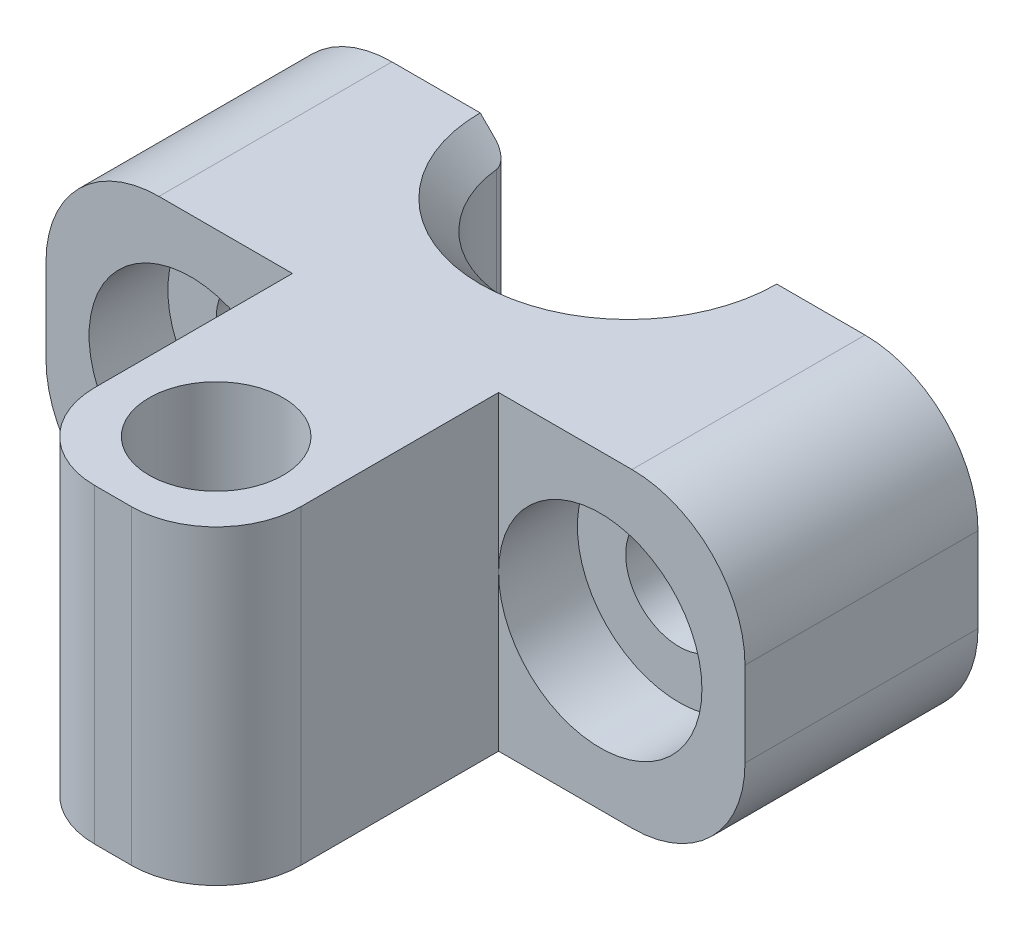
ISO-10303-21;
HEADER;
FILE_DESCRIPTION(('STEP AP214'),'2;1');
FILE_NAME('part.step','',(''),(''),'','','');
FILE_SCHEMA(('AUTOMOTIVE_DESIGN { 1 0 10303 214 1 1 1 1 }'));
ENDSEC;
DATA;
#1=APPLICATION_CONTEXT('core data for automotive mechanical design processes');
#2=APPLICATION_PROTOCOL_DEFINITION('international standard','automotive_design',2000,#1);
#3=PRODUCT_CONTEXT('',#1,'mechanical');
#4=PRODUCT('Part','Part','',(#3));
#5=PRODUCT_RELATED_PRODUCT_CATEGORY('part','',(#4));
#6=PRODUCT_DEFINITION_FORMATION('','',#4);
#7=PRODUCT_DEFINITION_CONTEXT('part definition',#1,'design');
#8=PRODUCT_DEFINITION('design','',#6,#7);
#9=PRODUCT_DEFINITION_SHAPE('','',#8);
#10=(LENGTH_UNIT() NAMED_UNIT(*) SI_UNIT(.MILLI.,.METRE.));
#11=(NAMED_UNIT(*) PLANE_ANGLE_UNIT() SI_UNIT($,.RADIAN.));
#12=(NAMED_UNIT(*) SI_UNIT($,.STERADIAN.) SOLID_ANGLE_UNIT());
#13=UNCERTAINTY_MEASURE_WITH_UNIT(LENGTH_MEASURE(1.E-05),#10,'distance_accuracy_value','');
#14=(GEOMETRIC_REPRESENTATION_CONTEXT(3) GLOBAL_UNCERTAINTY_ASSIGNED_CONTEXT((#13)) GLOBAL_UNIT_ASSIGNED_CONTEXT((#10,
#11,#12)) REPRESENTATION_CONTEXT('',''));
#15=CARTESIAN_POINT('',(0.,0.,0.));
#16=DIRECTION('',(0.,0.,1.));
#17=DIRECTION('',(1.,0.,0.));
#18=AXIS2_PLACEMENT_3D('',#15,#16,#17);
#19=CARTESIAN_POINT('',(0.,0.,8.25));
#20=DIRECTION('',(0.,0.,-1.));
#21=DIRECTION('',(-1.,0.,0.));
#22=AXIS2_PLACEMENT_3D('',#19,#20,#21);
#23=PLANE('',#22);
#24=DIRECTION('',(0.,-1.,0.));
#25=VECTOR('',#24,1.);
#26=CARTESIAN_POINT('',(-3.65000000000001,5.50000000000001,8.25));
#27=LINE('',#26,#25);
#28=CARTESIAN_POINT('',(-3.65000000000001,5.5,8.25));
#29=VERTEX_POINT('',#28);
#30=CARTESIAN_POINT('',(-3.65000000000001,0.,8.25));
#31=VERTEX_POINT('',#30);
#32=EDGE_CURVE('E201',#29,#31,#27,.T.);
#33=ORIENTED_EDGE('',*,*,#32,.F.);
#34=DIRECTION('',(1.,0.,0.));
#35=VECTOR('',#34,1.);
#36=CARTESIAN_POINT('',(-12.375,5.50000000000001,8.25));
#37=LINE('',#36,#35);
#38=CARTESIAN_POINT('',(-8.375,5.5,8.25));
#39=VERTEX_POINT('',#38);
#40=EDGE_CURVE('E256',#39,#29,#37,.T.);
#41=ORIENTED_EDGE('',*,*,#40,.F.);
#42=CARTESIAN_POINT('',(-8.375,1.5,8.25));
#43=DIRECTION('',(0.,0.,-1.));
#44=DIRECTION('',(-1.,0.,0.));
#45=AXIS2_PLACEMENT_3D('',#42,#43,#44);
#46=CIRCLE('',#45,4.);
#47=CARTESIAN_POINT('',(-12.375,1.5,8.25));
#48=VERTEX_POINT('',#47);
#49=EDGE_CURVE('E670',#39,#48,#46,.F.);
#50=ORIENTED_EDGE('',*,*,#49,.T.);
#51=DIRECTION('',(0.,1.,0.));
#52=VECTOR('',#51,1.);
#53=CARTESIAN_POINT('',(-12.375,-5.50000000000001,8.25));
#54=LINE('',#53,#52);
#55=CARTESIAN_POINT('',(-12.375,-1.50000000000001,8.25));
#56=VERTEX_POINT('',#55);
#57=EDGE_CURVE('E263',#56,#48,#54,.T.);
#58=ORIENTED_EDGE('',*,*,#57,.F.);
#59=CARTESIAN_POINT('',(-8.375,-1.50000000000001,8.25));
#60=DIRECTION('',(0.,0.,-1.));
#61=DIRECTION('',(-1.,0.,0.));
#62=AXIS2_PLACEMENT_3D('',#59,#60,#61);
#63=CIRCLE('',#62,4.);
#64=CARTESIAN_POINT('',(-8.375,-5.50000000000001,8.25));
#65=VERTEX_POINT('',#64);
#66=EDGE_CURVE('E194',#56,#65,#63,.F.);
#67=ORIENTED_EDGE('',*,*,#66,.T.);
#68=DIRECTION('',(-1.,0.,0.));
#69=VECTOR('',#68,1.);
#70=CARTESIAN_POINT('',(12.375,-5.50000000000001,8.25));
#71=LINE('',#70,#69);
#72=CARTESIAN_POINT('',(-3.65000000000001,-5.50000000000001,8.25));
#73=VERTEX_POINT('',#72);
#74=EDGE_CURVE('E179',#73,#65,#71,.T.);
#75=ORIENTED_EDGE('',*,*,#74,.F.);
#76=EDGE_CURVE('E190',#31,#73,#27,.T.);
#77=ORIENTED_EDGE('',*,*,#76,.F.);
#78=CARTESIAN_POINT('',(-7.25,0.,8.25));
#79=DIRECTION('',(0.,0.,1.));
#80=DIRECTION('',(1.,0.,0.));
#81=AXIS2_PLACEMENT_3D('',#78,#79,#80);
#82=CIRCLE('',#81,3.6);
#83=EDGE_CURVE('E232',#31,#31,#82,.T.);
#84=ORIENTED_EDGE('',*,*,#83,.F.);
#85=EDGE_LOOP('',(#33,#41,#50,#58,#67,#75,#77,#84));
#86=FACE_BOUND('',#85,.T.);
#87=ADVANCED_FACE('F33',(#86),#23,.F.);
#88=CARTESIAN_POINT('',(0.,0.,0.));
#89=DIRECTION('',(0.,0.,-1.));
#90=DIRECTION('',(-1.,0.,0.));
#91=AXIS2_PLACEMENT_3D('',#88,#89,#90);
#92=PLANE('',#91);
#93=DIRECTION('',(-1.,0.,0.));
#94=VECTOR('',#93,1.);
#95=CARTESIAN_POINT('',(12.375,-5.50000000000001,0.));
#96=LINE('',#95,#94);
#97=CARTESIAN_POINT('',(-5.25000000003318,-5.50000000000001,0.));
#98=VERTEX_POINT('',#97);
#99=CARTESIAN_POINT('',(-8.375,-5.50000000000001,0.));
#100=VERTEX_POINT('',#99);
#101=EDGE_CURVE('E272',#98,#100,#96,.T.);
#102=ORIENTED_EDGE('',*,*,#101,.T.);
#103=CARTESIAN_POINT('',(-8.375,-1.50000000000001,0.));
#104=DIRECTION('',(0.,0.,-1.));
#105=DIRECTION('',(-1.,0.,0.));
#106=AXIS2_PLACEMENT_3D('',#103,#104,#105);
#107=CIRCLE('',#106,4.);
#108=CARTESIAN_POINT('',(-12.375,-1.50000000000001,0.));
#109=VERTEX_POINT('',#108);
#110=EDGE_CURVE('E684',#100,#109,#107,.T.);
#111=ORIENTED_EDGE('',*,*,#110,.T.);
#112=DIRECTION('',(0.,1.,0.));
#113=VECTOR('',#112,1.);
#114=CARTESIAN_POINT('',(-12.375,-5.50000000000001,0.));
#115=LINE('',#114,#113);
#116=CARTESIAN_POINT('',(-12.375,1.5,0.));
#117=VERTEX_POINT('',#116);
#118=EDGE_CURVE('E275',#109,#117,#115,.T.);
#119=ORIENTED_EDGE('',*,*,#118,.T.);
#120=CARTESIAN_POINT('',(-8.375,1.5,0.));
#121=DIRECTION('',(0.,0.,-1.));
#122=DIRECTION('',(-1.,0.,0.));
#123=AXIS2_PLACEMENT_3D('',#120,#121,#122);
#124=CIRCLE('',#123,4.);
#125=CARTESIAN_POINT('',(-8.375,5.5,0.));
#126=VERTEX_POINT('',#125);
#127=EDGE_CURVE('E682',#117,#126,#124,.T.);
#128=ORIENTED_EDGE('',*,*,#127,.T.);
#129=DIRECTION('',(1.,0.,0.));
#130=VECTOR('',#129,1.);
#131=CARTESIAN_POINT('',(-12.375,5.50000000000001,0.));
#132=LINE('',#131,#130);
#133=CARTESIAN_POINT('',(-5.2500000000332,5.5,0.));
#134=VERTEX_POINT('',#133);
#135=EDGE_CURVE('E267',#126,#134,#132,.T.);
#136=ORIENTED_EDGE('',*,*,#135,.T.);
#137=DIRECTION('',(-0.707106781186549,0.707106781186546,0.));
#138=VECTOR('',#137,1.);
#139=CARTESIAN_POINT('',(0.,0.249999999966837,0.));
#140=LINE('',#139,#138);
#141=CARTESIAN_POINT('',(-4.72361090692279,4.9736109068896,0.));
#142=VERTEX_POINT('',#141);
#143=EDGE_CURVE('E291',#134,#142,#140,.F.);
#144=ORIENTED_EDGE('',*,*,#143,.T.);
#145=DIRECTION('',(0.,-1.,0.));
#146=VECTOR('',#145,1.);
#147=CARTESIAN_POINT('',(-4.72361090692279,-4.49999999996681,0.));
#148=LINE('',#147,#146);
#149=CARTESIAN_POINT('',(-4.72361090692279,-4.97361090688961,0.));
#150=VERTEX_POINT('',#149);
#151=EDGE_CURVE('E338',#142,#150,#148,.T.);
#152=ORIENTED_EDGE('',*,*,#151,.T.);
#153=DIRECTION('',(0.707106781186546,0.707106781186549,0.));
#154=VECTOR('',#153,1.);
#155=CARTESIAN_POINT('',(0.,-0.249999999966797,0.));
#156=LINE('',#155,#154);
#157=EDGE_CURVE('E294',#150,#98,#156,.F.);
#158=ORIENTED_EDGE('',*,*,#157,.T.);
#159=EDGE_LOOP('',(#102,#111,#119,#128,#136,#144,#152,#158));
#160=FACE_BOUND('',#159,.T.);
#161=CARTESIAN_POINT('',(-7.25,0.,0.));
#162=DIRECTION('',(0.,0.,1.));
#163=DIRECTION('',(1.,0.,0.));
#164=AXIS2_PLACEMENT_3D('',#161,#162,#163);
#165=CIRCLE('',#164,1.89000000000001);
#166=CARTESIAN_POINT('',(-5.35999999999999,0.,0.));
#167=VERTEX_POINT('',#166);
#168=EDGE_CURVE('E240',#167,#167,#165,.T.);
#169=ORIENTED_EDGE('',*,*,#168,.T.);
#170=EDGE_LOOP('',(#169));
#171=FACE_BOUND('',#170,.T.);
#172=ADVANCED_FACE('F354',(#160,#171),#92,.T.);
#173=CARTESIAN_POINT('',(-12.375,5.50000000000001,8.25));
#174=DIRECTION('',(0.,1.,0.));
#175=DIRECTION('',(-1.,0.,0.));
#176=AXIS2_PLACEMENT_3D('',#173,#174,#175);
#177=PLANE('',#176);
#178=CARTESIAN_POINT('',(0.,5.50000000000001,14.6));
#179=DIRECTION('',(0.,1.,0.));
#180=DIRECTION('',(0.,0.,1.));
#181=AXIS2_PLACEMENT_3D('',#178,#179,#180);
#182=CIRCLE('',#181,2.375);
#183=CARTESIAN_POINT('',(0.,5.50000000000001,16.975));
#184=VERTEX_POINT('',#183);
#185=EDGE_CURVE('E216',#184,#184,#182,.T.);
#186=ORIENTED_EDGE('',*,*,#185,.F.);
#187=EDGE_LOOP('',(#186));
#188=FACE_BOUND('',#187,.T.);
#189=DIRECTION('',(-1.,0.,0.));
#190=VECTOR('',#189,1.);
#191=CARTESIAN_POINT('',(3.65000000000001,5.50000000000001,18.25));
#192=LINE('',#191,#190);
#193=CARTESIAN_POINT('',(0.650000000000005,5.50000000000001,18.25));
#194=VERTEX_POINT('',#193);
#195=CARTESIAN_POINT('',(-0.650000000000005,5.50000000000001,18.25));
#196=VERTEX_POINT('',#195);
#197=EDGE_CURVE('E214',#194,#196,#192,.T.);
#198=ORIENTED_EDGE('',*,*,#197,.F.);
#199=CARTESIAN_POINT('',(0.650000000000005,5.5,15.25));
#200=DIRECTION('',(0.,1.,0.));
#201=DIRECTION('',(-1.,0.,0.));
#202=AXIS2_PLACEMENT_3D('',#199,#200,#201);
#203=CIRCLE('',#202,3.);
#204=CARTESIAN_POINT('',(3.65000000000001,5.50000000000001,15.25));
#205=VERTEX_POINT('',#204);
#206=EDGE_CURVE('E41',#194,#205,#203,.T.);
#207=ORIENTED_EDGE('',*,*,#206,.T.);
#208=DIRECTION('',(0.,0.,-1.));
#209=VECTOR('',#208,1.);
#210=CARTESIAN_POINT('',(3.65000000000001,5.50000000000001,18.25));
#211=LINE('',#210,#209);
#212=CARTESIAN_POINT('',(3.65,5.5,8.25));
#213=VERTEX_POINT('',#212);
#214=EDGE_CURVE('E224',#205,#213,#211,.T.);
#215=ORIENTED_EDGE('',*,*,#214,.T.);
#216=CARTESIAN_POINT('',(8.375,5.5,8.25));
#217=VERTEX_POINT('',#216);
#218=EDGE_CURVE('E259',#213,#217,#37,.T.);
#219=ORIENTED_EDGE('',*,*,#218,.T.);
#220=DIRECTION('',(0.,0.,-1.));
#221=VECTOR('',#220,1.);
#222=CARTESIAN_POINT('',(8.375,5.5,8.25));
#223=LINE('',#222,#221);
#224=CARTESIAN_POINT('',(8.375,5.5,0.));
#225=VERTEX_POINT('',#224);
#226=EDGE_CURVE('E203',#217,#225,#223,.T.);
#227=ORIENTED_EDGE('',*,*,#226,.T.);
#228=CARTESIAN_POINT('',(5.25000000003319,5.5,0.));
#229=VERTEX_POINT('',#228);
#230=EDGE_CURVE('E255',#229,#225,#132,.T.);
#231=ORIENTED_EDGE('',*,*,#230,.F.);
#232=CARTESIAN_POINT('',(0.,5.5,0.));
#233=DIRECTION('',(0.,1.,0.));
#234=DIRECTION('',(-1.,0.,0.));
#235=AXIS2_PLACEMENT_3D('',#232,#233,#234);
#236=CIRCLE('',#235,5.25000000003319);
#237=EDGE_CURVE('E296',#229,#134,#236,.F.);
#238=ORIENTED_EDGE('',*,*,#237,.T.);
#239=ORIENTED_EDGE('',*,*,#135,.F.);
#240=DIRECTION('',(0.,0.,-1.));
#241=VECTOR('',#240,1.);
#242=CARTESIAN_POINT('',(-8.375,5.5,8.25));
#243=LINE('',#242,#241);
#244=EDGE_CURVE('E210',#126,#39,#243,.F.);
#245=ORIENTED_EDGE('',*,*,#244,.T.);
#246=ORIENTED_EDGE('',*,*,#40,.T.);
#247=DIRECTION('',(0.,0.,-1.));
#248=VECTOR('',#247,1.);
#249=CARTESIAN_POINT('',(-3.65000000000001,5.50000000000001,18.25));
#250=LINE('',#249,#248);
#251=CARTESIAN_POINT('',(-3.65000000000001,5.50000000000001,15.25));
#252=VERTEX_POINT('',#251);
#253=EDGE_CURVE('E184',#252,#29,#250,.T.);
#254=ORIENTED_EDGE('',*,*,#253,.F.);
#255=CARTESIAN_POINT('',(-0.650000000000005,5.5,15.25));
#256=DIRECTION('',(0.,1.,0.));
#257=DIRECTION('',(-1.,0.,0.));
#258=AXIS2_PLACEMENT_3D('',#255,#256,#257);
#259=CIRCLE('',#258,3.);
#260=EDGE_CURVE('E53',#252,#196,#259,.T.);
#261=ORIENTED_EDGE('',*,*,#260,.T.);
#262=EDGE_LOOP('',(#198,#207,#215,#219,#227,#231,#238,#239,#245,#246,#254,#261));
#263=FACE_BOUND('',#262,.T.);
#264=ADVANCED_FACE('F349',(#188,#263),#177,.T.);
#265=CARTESIAN_POINT('',(-12.375,-5.50000000000001,8.25));
#266=DIRECTION('',(-1.,0.,0.));
#267=DIRECTION('',(0.,0.,1.));
#268=AXIS2_PLACEMENT_3D('',#265,#266,#267);
#269=PLANE('',#268);
#270=ORIENTED_EDGE('',*,*,#118,.F.);
#271=DIRECTION('',(0.,0.,-1.));
#272=VECTOR('',#271,1.);
#273=CARTESIAN_POINT('',(-12.375,-1.50000000000001,8.25));
#274=LINE('',#273,#272);
#275=EDGE_CURVE('E441',#109,#56,#274,.F.);
#276=ORIENTED_EDGE('',*,*,#275,.T.);
#277=ORIENTED_EDGE('',*,*,#57,.T.);
#278=DIRECTION('',(0.,0.,-1.));
#279=VECTOR('',#278,1.);
#280=CARTESIAN_POINT('',(-12.375,1.5,8.25));
#281=LINE('',#280,#279);
#282=EDGE_CURVE('E443',#48,#117,#281,.T.);
#283=ORIENTED_EDGE('',*,*,#282,.T.);
#284=EDGE_LOOP('',(#270,#276,#277,#283));
#285=FACE_BOUND('',#284,.T.);
#286=ADVANCED_FACE('F353',(#285),#269,.T.);
#287=CARTESIAN_POINT('',(12.375,-5.50000000000001,8.25));
#288=DIRECTION('',(0.,-1.,0.));
#289=DIRECTION('',(1.,0.,0.));
#290=AXIS2_PLACEMENT_3D('',#287,#288,#289);
#291=PLANE('',#290);
#292=CARTESIAN_POINT('',(0.,-5.50000000000001,14.6));
#293=DIRECTION('',(0.,1.,0.));
#294=DIRECTION('',(0.,0.,1.));
#295=AXIS2_PLACEMENT_3D('',#292,#293,#294);
#296=CIRCLE('',#295,2.375);
#297=CARTESIAN_POINT('',(0.,-5.50000000000001,16.975));
#298=VERTEX_POINT('',#297);
#299=EDGE_CURVE('E213',#298,#298,#296,.T.);
#300=ORIENTED_EDGE('',*,*,#299,.T.);
#301=EDGE_LOOP('',(#300));
#302=FACE_BOUND('',#301,.T.);
#303=DIRECTION('',(0.,0.,-1.));
#304=VECTOR('',#303,1.);
#305=CARTESIAN_POINT('',(3.65000000000001,-5.50000000000001,18.25));
#306=LINE('',#305,#304);
#307=CARTESIAN_POINT('',(3.65000000000001,-5.50000000000001,15.25));
#308=VERTEX_POINT('',#307);
#309=CARTESIAN_POINT('',(3.65000000000001,-5.50000000000001,8.25));
#310=VERTEX_POINT('',#309);
#311=EDGE_CURVE('E185',#308,#310,#306,.T.);
#312=ORIENTED_EDGE('',*,*,#311,.F.);
#313=CARTESIAN_POINT('',(0.650000000000005,-5.50000000000001,15.25));
#314=DIRECTION('',(0.,-1.,0.));
#315=DIRECTION('',(1.,0.,0.));
#316=AXIS2_PLACEMENT_3D('',#313,#314,#315);
#317=CIRCLE('',#316,3.);
#318=CARTESIAN_POINT('',(0.650000000000005,-5.50000000000001,18.25));
#319=VERTEX_POINT('',#318);
#320=EDGE_CURVE('E450',#308,#319,#317,.T.);
#321=ORIENTED_EDGE('',*,*,#320,.T.);
#322=DIRECTION('',(-1.,0.,0.));
#323=VECTOR('',#322,1.);
#324=CARTESIAN_POINT('',(3.65000000000001,-5.50000000000001,18.25));
#325=LINE('',#324,#323);
#326=CARTESIAN_POINT('',(-0.650000000000005,-5.50000000000001,18.25));
#327=VERTEX_POINT('',#326);
#328=EDGE_CURVE('E223',#319,#327,#325,.T.);
#329=ORIENTED_EDGE('',*,*,#328,.T.);
#330=CARTESIAN_POINT('',(-0.650000000000005,-5.50000000000001,15.25));
#331=DIRECTION('',(0.,-1.,0.));
#332=DIRECTION('',(1.,0.,0.));
#333=AXIS2_PLACEMENT_3D('',#330,#331,#332);
#334=CIRCLE('',#333,3.);
#335=CARTESIAN_POINT('',(-3.65000000000001,-5.50000000000001,15.25));
#336=VERTEX_POINT('',#335);
#337=EDGE_CURVE('E182',#327,#336,#334,.T.);
#338=ORIENTED_EDGE('',*,*,#337,.T.);
#339=DIRECTION('',(0.,0.,-1.));
#340=VECTOR('',#339,1.);
#341=CARTESIAN_POINT('',(-3.65000000000001,-5.50000000000001,18.25));
#342=LINE('',#341,#340);
#343=EDGE_CURVE('E174',#336,#73,#342,.T.);
#344=ORIENTED_EDGE('',*,*,#343,.T.);
#345=ORIENTED_EDGE('',*,*,#74,.T.);
#346=DIRECTION('',(0.,0.,-1.));
#347=VECTOR('',#346,1.);
#348=CARTESIAN_POINT('',(-8.375,-5.50000000000001,8.25));
#349=LINE('',#348,#347);
#350=EDGE_CURVE('E671',#65,#100,#349,.T.);
#351=ORIENTED_EDGE('',*,*,#350,.T.);
#352=ORIENTED_EDGE('',*,*,#101,.F.);
#353=CARTESIAN_POINT('',(0.,-5.50000000000001,0.));
#354=DIRECTION('',(0.,-1.,0.));
#355=DIRECTION('',(1.,0.,0.));
#356=AXIS2_PLACEMENT_3D('',#353,#354,#355);
#357=CIRCLE('',#356,5.25000000003318);
#358=CARTESIAN_POINT('',(5.25000000003318,-5.50000000000001,0.));
#359=VERTEX_POINT('',#358);
#360=EDGE_CURVE('E266',#98,#359,#357,.F.);
#361=ORIENTED_EDGE('',*,*,#360,.T.);
#362=CARTESIAN_POINT('',(8.375,-5.50000000000001,0.));
#363=VERTEX_POINT('',#362);
#364=EDGE_CURVE('E273',#363,#359,#96,.T.);
#365=ORIENTED_EDGE('',*,*,#364,.F.);
#366=DIRECTION('',(0.,0.,-1.));
#367=VECTOR('',#366,1.);
#368=CARTESIAN_POINT('',(8.375,-5.50000000000001,8.25));
#369=LINE('',#368,#367);
#370=CARTESIAN_POINT('',(8.375,-5.50000000000001,8.25));
#371=VERTEX_POINT('',#370);
#372=EDGE_CURVE('E664',#363,#371,#369,.F.);
#373=ORIENTED_EDGE('',*,*,#372,.T.);
#374=EDGE_CURVE('E196',#371,#310,#71,.T.);
#375=ORIENTED_EDGE('',*,*,#374,.T.);
#376=EDGE_LOOP('',(#312,#321,#329,#338,#344,#345,#351,#352,#361,#365,#373,#375));
#377=FACE_BOUND('',#376,.T.);
#378=ADVANCED_FACE('F177',(#302,#377),#291,.T.);
#379=CARTESIAN_POINT('',(12.375,5.5,8.25));
#380=DIRECTION('',(1.,0.,0.));
#381=DIRECTION('',(0.,0.,-1.));
#382=AXIS2_PLACEMENT_3D('',#379,#380,#381);
#383=PLANE('',#382);
#384=DIRECTION('',(0.,-1.,0.));
#385=VECTOR('',#384,1.);
#386=CARTESIAN_POINT('',(12.375,5.5,8.25));
#387=LINE('',#386,#385);
#388=CARTESIAN_POINT('',(12.375,1.5,8.25));
#389=VERTEX_POINT('',#388);
#390=CARTESIAN_POINT('',(12.375,-1.50000000000001,8.25));
#391=VERTEX_POINT('',#390);
#392=EDGE_CURVE('E197',#389,#391,#387,.T.);
#393=ORIENTED_EDGE('',*,*,#392,.T.);
#394=DIRECTION('',(0.,0.,-1.));
#395=VECTOR('',#394,1.);
#396=CARTESIAN_POINT('',(12.375,-1.50000000000001,8.25));
#397=LINE('',#396,#395);
#398=CARTESIAN_POINT('',(12.375,-1.50000000000001,0.));
#399=VERTEX_POINT('',#398);
#400=EDGE_CURVE('E692',#391,#399,#397,.T.);
#401=ORIENTED_EDGE('',*,*,#400,.T.);
#402=DIRECTION('',(0.,-1.,0.));
#403=VECTOR('',#402,1.);
#404=CARTESIAN_POINT('',(12.375,5.5,0.));
#405=LINE('',#404,#403);
#406=CARTESIAN_POINT('',(12.375,1.5,0.));
#407=VERTEX_POINT('',#406);
#408=EDGE_CURVE('E269',#407,#399,#405,.T.);
#409=ORIENTED_EDGE('',*,*,#408,.F.);
#410=DIRECTION('',(0.,0.,-1.));
#411=VECTOR('',#410,1.);
#412=CARTESIAN_POINT('',(12.375,1.5,8.25));
#413=LINE('',#412,#411);
#414=EDGE_CURVE('E691',#407,#389,#413,.F.);
#415=ORIENTED_EDGE('',*,*,#414,.T.);
#416=EDGE_LOOP('',(#393,#401,#409,#415));
#417=FACE_BOUND('',#416,.T.);
#418=ADVANCED_FACE('F356',(#417),#383,.T.);
#419=ORIENTED_EDGE('',*,*,#218,.F.);
#420=DIRECTION('',(0.,-1.,0.));
#421=VECTOR('',#420,1.);
#422=CARTESIAN_POINT('',(3.65000000000001,5.50000000000001,8.25));
#423=LINE('',#422,#421);
#424=CARTESIAN_POINT('',(3.65000000000001,0.,8.25));
#425=VERTEX_POINT('',#424);
#426=EDGE_CURVE('E208',#213,#425,#423,.T.);
#427=ORIENTED_EDGE('',*,*,#426,.T.);
#428=CARTESIAN_POINT('',(7.25,0.,8.25));
#429=DIRECTION('',(0.,0.,1.));
#430=DIRECTION('',(1.,0.,0.));
#431=AXIS2_PLACEMENT_3D('',#428,#429,#430);
#432=CIRCLE('',#431,3.59999999999999);
#433=EDGE_CURVE('E243',#425,#425,#432,.T.);
#434=ORIENTED_EDGE('',*,*,#433,.F.);
#435=EDGE_CURVE('E202',#425,#310,#423,.T.);
#436=ORIENTED_EDGE('',*,*,#435,.T.);
#437=ORIENTED_EDGE('',*,*,#374,.F.);
#438=CARTESIAN_POINT('',(8.375,-1.50000000000001,8.25));
#439=DIRECTION('',(0.,0.,-1.));
#440=DIRECTION('',(-1.,0.,0.));
#441=AXIS2_PLACEMENT_3D('',#438,#439,#440);
#442=CIRCLE('',#441,4.);
#443=EDGE_CURVE('E669',#371,#391,#442,.F.);
#444=ORIENTED_EDGE('',*,*,#443,.T.);
#445=ORIENTED_EDGE('',*,*,#392,.F.);
#446=CARTESIAN_POINT('',(8.375,1.5,8.25));
#447=DIRECTION('',(0.,0.,-1.));
#448=DIRECTION('',(-1.,0.,0.));
#449=AXIS2_PLACEMENT_3D('',#446,#447,#448);
#450=CIRCLE('',#449,4.);
#451=EDGE_CURVE('E673',#389,#217,#450,.F.);
#452=ORIENTED_EDGE('',*,*,#451,.T.);
#453=EDGE_LOOP('',(#419,#427,#434,#436,#437,#444,#445,#452));
#454=FACE_BOUND('',#453,.T.);
#455=ADVANCED_FACE('F359',(#454),#23,.F.);
#456=ORIENTED_EDGE('',*,*,#408,.T.);
#457=CARTESIAN_POINT('',(8.375,-1.50000000000001,0.));
#458=DIRECTION('',(0.,0.,-1.));
#459=DIRECTION('',(-1.,0.,0.));
#460=AXIS2_PLACEMENT_3D('',#457,#458,#459);
#461=CIRCLE('',#460,4.);
#462=EDGE_CURVE('E662',#399,#363,#461,.T.);
#463=ORIENTED_EDGE('',*,*,#462,.T.);
#464=ORIENTED_EDGE('',*,*,#364,.T.);
#465=DIRECTION('',(0.707106781186546,-0.707106781186549,0.));
#466=VECTOR('',#465,1.);
#467=CARTESIAN_POINT('',(0.,-0.249999999966797,0.));
#468=LINE('',#467,#466);
#469=CARTESIAN_POINT('',(4.72361090692278,-4.97361090688961,0.));
#470=VERTEX_POINT('',#469);
#471=EDGE_CURVE('E282',#359,#470,#468,.F.);
#472=ORIENTED_EDGE('',*,*,#471,.T.);
#473=DIRECTION('',(0.,-1.,0.));
#474=VECTOR('',#473,1.);
#475=CARTESIAN_POINT('',(4.72361090692278,4.4999999999668,0.));
#476=LINE('',#475,#474);
#477=CARTESIAN_POINT('',(4.72361090692278,4.9736109068896,0.));
#478=VERTEX_POINT('',#477);
#479=EDGE_CURVE('E656',#470,#478,#476,.F.);
#480=ORIENTED_EDGE('',*,*,#479,.T.);
#481=DIRECTION('',(-0.707106781186549,-0.707106781186546,0.));
#482=VECTOR('',#481,1.);
#483=CARTESIAN_POINT('',(0.,0.249999999966837,0.));
#484=LINE('',#483,#482);
#485=EDGE_CURVE('E280',#478,#229,#484,.F.);
#486=ORIENTED_EDGE('',*,*,#485,.T.);
#487=ORIENTED_EDGE('',*,*,#230,.T.);
#488=CARTESIAN_POINT('',(8.375,1.5,0.));
#489=DIRECTION('',(0.,0.,-1.));
#490=DIRECTION('',(-1.,0.,0.));
#491=AXIS2_PLACEMENT_3D('',#488,#489,#490);
#492=CIRCLE('',#491,4.);
#493=EDGE_CURVE('E696',#225,#407,#492,.T.);
#494=ORIENTED_EDGE('',*,*,#493,.T.);
#495=EDGE_LOOP('',(#456,#463,#464,#472,#480,#486,#487,#494));
#496=FACE_BOUND('',#495,.T.);
#497=CARTESIAN_POINT('',(7.25,0.,0.));
#498=DIRECTION('',(0.,0.,1.));
#499=DIRECTION('',(1.,0.,0.));
#500=AXIS2_PLACEMENT_3D('',#497,#498,#499);
#501=CIRCLE('',#500,1.89000000000001);
#502=CARTESIAN_POINT('',(9.14000000000001,0.,0.));
#503=VERTEX_POINT('',#502);
#504=EDGE_CURVE('E252',#503,#503,#501,.T.);
#505=ORIENTED_EDGE('',*,*,#504,.T.);
#506=EDGE_LOOP('',(#505));
#507=FACE_BOUND('',#506,.T.);
#508=ADVANCED_FACE('F366',(#496,#507),#92,.T.);
#509=CARTESIAN_POINT('',(7.25,0.,8.25));
#510=DIRECTION('',(0.,0.,1.));
#511=DIRECTION('',(1.,0.,0.));
#512=AXIS2_PLACEMENT_3D('',#509,#510,#511);
#513=CYLINDRICAL_SURFACE('',#512,1.89000000000001);
#514=ORIENTED_EDGE('',*,*,#504,.F.);
#515=EDGE_LOOP('',(#514));
#516=FACE_BOUND('',#515,.T.);
#517=CARTESIAN_POINT('',(7.25,0.,5.46));
#518=DIRECTION('',(0.,0.,1.));
#519=DIRECTION('',(1.,0.,0.));
#520=AXIS2_PLACEMENT_3D('',#517,#518,#519);
#521=CIRCLE('',#520,1.89000000000001);
#522=CARTESIAN_POINT('',(9.14000000000001,0.,5.46));
#523=VERTEX_POINT('',#522);
#524=EDGE_CURVE('E249',#523,#523,#521,.T.);
#525=ORIENTED_EDGE('',*,*,#524,.T.);
#526=EDGE_LOOP('',(#525));
#527=FACE_BOUND('',#526,.T.);
#528=ADVANCED_FACE('F369',(#516,#527),#513,.F.);
#529=CARTESIAN_POINT('',(9.14000000000001,0.,5.46));
#530=DIRECTION('',(0.,0.,-1.));
#531=DIRECTION('',(-1.,0.,0.));
#532=AXIS2_PLACEMENT_3D('',#529,#530,#531);
#533=PLANE('',#532);
#534=ORIENTED_EDGE('',*,*,#524,.F.);
#535=EDGE_LOOP('',(#534));
#536=FACE_BOUND('',#535,.T.);
#537=CARTESIAN_POINT('',(7.25,0.,5.46));
#538=DIRECTION('',(0.,0.,1.));
#539=DIRECTION('',(1.,0.,0.));
#540=AXIS2_PLACEMENT_3D('',#537,#538,#539);
#541=CIRCLE('',#540,3.59999999999999);
#542=CARTESIAN_POINT('',(10.85,0.,5.46));
#543=VERTEX_POINT('',#542);
#544=EDGE_CURVE('E246',#543,#543,#541,.T.);
#545=ORIENTED_EDGE('',*,*,#544,.T.);
#546=EDGE_LOOP('',(#545));
#547=FACE_BOUND('',#546,.T.);
#548=ADVANCED_FACE('F376',(#536,#547),#533,.F.);
#549=CARTESIAN_POINT('',(7.25,0.,8.25));
#550=DIRECTION('',(0.,0.,1.));
#551=DIRECTION('',(1.,0.,0.));
#552=AXIS2_PLACEMENT_3D('',#549,#550,#551);
#553=CYLINDRICAL_SURFACE('',#552,3.59999999999999);
#554=ORIENTED_EDGE('',*,*,#544,.F.);
#555=EDGE_LOOP('',(#554));
#556=FACE_BOUND('',#555,.T.);
#557=ORIENTED_EDGE('',*,*,#433,.T.);
#558=EDGE_LOOP('',(#557));
#559=FACE_BOUND('',#558,.T.);
#560=ADVANCED_FACE('F380',(#556,#559),#553,.F.);
#561=CARTESIAN_POINT('',(-7.25,0.,8.25));
#562=DIRECTION('',(0.,0.,1.));
#563=DIRECTION('',(1.,0.,0.));
#564=AXIS2_PLACEMENT_3D('',#561,#562,#563);
#565=CYLINDRICAL_SURFACE('',#564,1.89000000000001);
#566=ORIENTED_EDGE('',*,*,#168,.F.);
#567=EDGE_LOOP('',(#566));
#568=FACE_BOUND('',#567,.T.);
#569=CARTESIAN_POINT('',(-7.25,0.,5.46));
#570=DIRECTION('',(0.,0.,1.));
#571=DIRECTION('',(1.,0.,0.));
#572=AXIS2_PLACEMENT_3D('',#569,#570,#571);
#573=CIRCLE('',#572,1.89000000000001);
#574=CARTESIAN_POINT('',(-5.35999999999999,0.,5.46));
#575=VERTEX_POINT('',#574);
#576=EDGE_CURVE('E237',#575,#575,#573,.T.);
#577=ORIENTED_EDGE('',*,*,#576,.T.);
#578=EDGE_LOOP('',(#577));
#579=FACE_BOUND('',#578,.T.);
#580=ADVANCED_FACE('F384',(#568,#579),#565,.F.);
#581=CARTESIAN_POINT('',(-5.35999999999999,0.,5.46));
#582=DIRECTION('',(0.,0.,-1.));
#583=DIRECTION('',(-1.,0.,0.));
#584=AXIS2_PLACEMENT_3D('',#581,#582,#583);
#585=PLANE('',#584);
#586=ORIENTED_EDGE('',*,*,#576,.F.);
#587=EDGE_LOOP('',(#586));
#588=FACE_BOUND('',#587,.T.);
#589=CARTESIAN_POINT('',(-7.25,0.,5.46));
#590=DIRECTION('',(0.,0.,1.));
#591=DIRECTION('',(1.,0.,0.));
#592=AXIS2_PLACEMENT_3D('',#589,#590,#591);
#593=CIRCLE('',#592,3.6);
#594=CARTESIAN_POINT('',(-3.65,0.,5.46));
#595=VERTEX_POINT('',#594);
#596=EDGE_CURVE('E234',#595,#595,#593,.T.);
#597=ORIENTED_EDGE('',*,*,#596,.T.);
#598=EDGE_LOOP('',(#597));
#599=FACE_BOUND('',#598,.T.);
#600=ADVANCED_FACE('F388',(#588,#599),#585,.F.);
#601=CARTESIAN_POINT('',(-7.25,0.,8.25));
#602=DIRECTION('',(0.,0.,1.));
#603=DIRECTION('',(1.,0.,0.));
#604=AXIS2_PLACEMENT_3D('',#601,#602,#603);
#605=CYLINDRICAL_SURFACE('',#604,3.6);
#606=ORIENTED_EDGE('',*,*,#596,.F.);
#607=EDGE_LOOP('',(#606));
#608=FACE_BOUND('',#607,.T.);
#609=ORIENTED_EDGE('',*,*,#83,.T.);
#610=EDGE_LOOP('',(#609));
#611=FACE_BOUND('',#610,.T.);
#612=ADVANCED_FACE('F392',(#608,#611),#605,.F.);
#613=CARTESIAN_POINT('',(0.,5.5,0.));
#614=DIRECTION('',(0.,1.,0.));
#615=DIRECTION('',(0.,0.,1.));
#616=AXIS2_PLACEMENT_3D('',#613,#614,#615);
#617=CYLINDRICAL_SURFACE('',#616,4.24999999999999);
#618=CARTESIAN_POINT('',(0.,-4.49999999996681,0.));
#619=DIRECTION('',(0.,-1.,0.));
#620=DIRECTION('',(0.,0.,-1.));
#621=AXIS2_PLACEMENT_3D('',#618,#619,#620);
#622=CIRCLE('',#621,4.24999999999999);
#623=CARTESIAN_POINT('',(4.22638870619407,-4.49999999996681,0.447368421052631));
#624=VERTEX_POINT('',#623);
#625=CARTESIAN_POINT('',(-4.22638870619407,-4.49999999996681,0.447368421052631));
#626=VERTEX_POINT('',#625);
#627=EDGE_CURVE('E288',#624,#626,#622,.T.);
#628=ORIENTED_EDGE('',*,*,#627,.T.);
#629=DIRECTION('',(0.,1.,0.));
#630=VECTOR('',#629,1.);
#631=CARTESIAN_POINT('',(-4.22638870619407,5.5,0.447368421052631));
#632=LINE('',#631,#630);
#633=CARTESIAN_POINT('',(-4.22638870619407,4.4999999999668,0.447368421052631));
#634=VERTEX_POINT('',#633);
#635=EDGE_CURVE('E302',#626,#634,#632,.T.);
#636=ORIENTED_EDGE('',*,*,#635,.T.);
#637=CARTESIAN_POINT('',(0.,4.4999999999668,0.));
#638=DIRECTION('',(0.,1.,0.));
#639=DIRECTION('',(0.,0.,1.));
#640=AXIS2_PLACEMENT_3D('',#637,#638,#639);
#641=CIRCLE('',#640,4.24999999999999);
#642=CARTESIAN_POINT('',(4.22638870619407,4.4999999999668,0.447368421052631));
#643=VERTEX_POINT('',#642);
#644=EDGE_CURVE('E285',#634,#643,#641,.T.);
#645=ORIENTED_EDGE('',*,*,#644,.T.);
#646=DIRECTION('',(0.,1.,0.));
#647=VECTOR('',#646,1.);
#648=CARTESIAN_POINT('',(4.22638870619407,5.5,0.447368421052631));
#649=LINE('',#648,#647);
#650=EDGE_CURVE('E299',#643,#624,#649,.F.);
#651=ORIENTED_EDGE('',*,*,#650,.T.);
#652=EDGE_LOOP('',(#628,#636,#645,#651));
#653=FACE_BOUND('',#652,.T.);
#654=ADVANCED_FACE('F347',(#653),#617,.F.);
#655=CARTESIAN_POINT('',(0.,-5.50000000000001,0.));
#656=DIRECTION('',(0.,-1.,0.));
#657=DIRECTION('',(0.,0.,-1.));
#658=AXIS2_PLACEMENT_3D('',#655,#656,#657);
#659=CONICAL_SURFACE('',#658,5.25000000003318,0.785398163397446);
#660=ORIENTED_EDGE('',*,*,#157,.F.);
#661=CARTESIAN_POINT('',(-4.72361090692279,-4.97361090688961,0.));
#662=CARTESIAN_POINT('',(-4.70451559799697,-4.95451737792977,5.74578598498488E-06));
#663=CARTESIAN_POINT('',(-4.68541942708042,-4.93541951605333,0.00109428033940479));
#664=CARTESIAN_POINT('',(-4.64732207919542,-4.8973243046975,0.00548019882647968));
#665=CARTESIAN_POINT('',(-4.62832109708245,-4.87832715869337,0.00878102866187079));
#666=CARTESIAN_POINT('',(-4.59036928713761,-4.84040120969419,0.0176824178871104));
#667=CARTESIAN_POINT('',(-4.57142117166191,-4.82147531324672,0.0233072078518022));
#668=CARTESIAN_POINT('',(-4.53394967233196,-4.78409483708891,0.0369386143152173));
#669=CARTESIAN_POINT('',(-4.51542597755819,-4.76563991115127,0.0449434230035749));
#670=CARTESIAN_POINT('',(-4.47307241881882,-4.7235481427248,0.0664526714751249));
#671=CARTESIAN_POINT('',(-4.44945992491758,-4.7001616137765,0.080898294158464));
#672=CARTESIAN_POINT('',(-4.40390468806834,-4.65535969640405,0.114531237282875));
#673=CARTESIAN_POINT('',(-4.38195636847287,-4.63393766931531,0.133701714720097));
#674=CARTESIAN_POINT('',(-4.34613491009343,-4.59948158833207,0.171376197289017));
#675=CARTESIAN_POINT('',(-4.33167756683719,-4.58574113501358,0.188672762057519));
#676=CARTESIAN_POINT('',(-4.30462788036671,-4.56052177333043,0.226165166266373));
#677=CARTESIAN_POINT('',(-4.2920335647123,-4.54904046882509,0.246357894178167));
#678=CARTESIAN_POINT('',(-4.27178146513749,-4.53124247059607,0.285007620132869));
#679=CARTESIAN_POINT('',(-4.26364214288788,-4.52434781716947,0.302944037281931));
#680=CARTESIAN_POINT('',(-4.24938185173746,-4.51294338529187,0.34030052002936));
#681=CARTESIAN_POINT('',(-4.24325622081007,-4.50842808341296,0.359717028620896));
#682=CARTESIAN_POINT('',(-4.23557599097398,-4.50354015045773,0.390674928522668));
#683=CARTESIAN_POINT('',(-4.23320053968178,-4.50221814166536,0.401873352712115));
#684=CARTESIAN_POINT('',(-4.22921201522787,-4.50044601070973,0.424487006095318));
#685=CARTESIAN_POINT('',(-4.22759988679139,-4.49999696684745,0.435902485856072));
#686=CARTESIAN_POINT('',(-4.2263887061937,-4.49999999996638,0.447368421052472));
#687=B_SPLINE_CURVE_WITH_KNOTS('',3,(#661,#662,#663,#664,#665,#666,#667,#668,#669,#670,#671,
#672,#673,#674,#675,#676,#677,#678,#679,#680,#681,#682,#683,#684,#685,#686),.UNSPECIFIED.,.F.,
.F.,(4,2,2,2,2,2,2,2,2,2,2,2,4),(0.,0.0809946371767588,0.162115726824847,0.244104862375673,
0.326031879177829,0.434405373530558,0.542397991946375,0.621345897001138,0.700209610067577,
0.762575408956173,0.824795786862058,0.85931196268443,0.893870746446602),.UNSPECIFIED.);
#688=EDGE_CURVE('E337',#150,#626,#687,.T.);
#689=ORIENTED_EDGE('',*,*,#688,.T.);
#690=ORIENTED_EDGE('',*,*,#627,.F.);
#691=CARTESIAN_POINT('',(4.22638870619407,-4.49999999996681,0.447368421052631));
#692=CARTESIAN_POINT('',(4.22865137290567,-4.49995396282857,0.425625922930036));
#693=CARTESIAN_POINT('',(4.23240622727772,-4.50159926444922,0.404112162015551));
#694=CARTESIAN_POINT('',(4.24246424371683,-4.50786109558739,0.362364529279287));
#695=CARTESIAN_POINT('',(4.24874099289562,-4.51244711364019,0.342119831433334));
#696=CARTESIAN_POINT('',(4.26344222831816,-4.52417248707712,0.303334252733933));
#697=CARTESIAN_POINT('',(4.27185888457753,-4.53130257121672,0.284787488586978));
#698=CARTESIAN_POINT('',(4.29041733274829,-4.5476283916758,0.249518089586861));
#699=CARTESIAN_POINT('',(4.30056376671647,-4.55682970825019,0.232800567290096));
#700=CARTESIAN_POINT('',(4.32734176546488,-4.58161150182119,0.193784749292943));
#701=CARTESIAN_POINT('',(4.34475775809253,-4.59814099293177,0.172629351512955));
#702=CARTESIAN_POINT('',(4.38153021764735,-4.63354546679922,0.134366744057275));
#703=CARTESIAN_POINT('',(4.40089080432651,-4.65242545038238,0.117268398441175));
#704=CARTESIAN_POINT('',(4.44953219017115,-4.70019893635609,0.08026739276745));
#705=CARTESIAN_POINT('',(4.47949803370169,-4.72990653415996,0.0623219077147714));
#706=CARTESIAN_POINT('',(4.54094113638697,-4.79103969909765,0.0333238611405922));
#707=CARTESIAN_POINT('',(4.5724200610773,-4.82246716491418,0.0222790918446614));
#708=CARTESIAN_POINT('',(4.62401455808331,-4.87402209438028,0.0095983134657));
#709=CARTESIAN_POINT('',(4.64390814606928,-4.89391094191598,0.00598228700440294));
#710=CARTESIAN_POINT('',(4.68373701598429,-4.9337369748816,0.00119272611058303));
#711=CARTESIAN_POINT('',(4.70367156897721,-4.95367339764515,6.84018999686426E-06));
#712=CARTESIAN_POINT('',(4.72361090692278,-4.97361090688961,0.));
#713=B_SPLINE_CURVE_WITH_KNOTS('',3,(#691,#692,#693,#694,#695,#696,#697,#698,#699,#700,#701,
#702,#703,#704,#705,#706,#707,#708,#709,#710,#711,#712),.UNSPECIFIED.,.F.,.F.,(4,2,2,2,2,2,2,2,
2,2,4),(0.,0.0653570262004379,0.130046676361992,0.194502948671287,0.259135001011082,
0.354604057209093,0.450279817110325,0.58710858187134,0.724091574509869,0.809081061024956,
0.893637495733797),.UNSPECIFIED.);
#714=EDGE_CURVE('E332',#624,#470,#713,.T.);
#715=ORIENTED_EDGE('',*,*,#714,.T.);
#716=ORIENTED_EDGE('',*,*,#471,.F.);
#717=ORIENTED_EDGE('',*,*,#360,.F.);
#718=EDGE_LOOP('',(#660,#689,#690,#715,#716,#717));
#719=FACE_BOUND('',#718,.T.);
#720=ADVANCED_FACE('F343',(#719),#659,.F.);
#721=CARTESIAN_POINT('',(0.,4.4999999999668,0.));
#722=DIRECTION('',(0.,1.,0.));
#723=DIRECTION('',(0.,0.,1.));
#724=AXIS2_PLACEMENT_3D('',#721,#722,#723);
#725=CONICAL_SURFACE('',#724,4.24999999999999,0.785398163397451);
#726=ORIENTED_EDGE('',*,*,#644,.F.);
#727=CARTESIAN_POINT('',(-4.22638870619407,4.4999999999668,0.447368421052631));
#728=CARTESIAN_POINT('',(-4.22865137290568,4.49995396282856,0.425625922930036));
#729=CARTESIAN_POINT('',(-4.23240622727773,4.50159926444922,0.404112162015551));
#730=CARTESIAN_POINT('',(-4.24246424371684,4.50786109558738,0.362364529279287));
#731=CARTESIAN_POINT('',(-4.24874099289562,4.51244711364019,0.342119831433334));
#732=CARTESIAN_POINT('',(-4.26344222831816,4.52417248707711,0.303334252733932));
#733=CARTESIAN_POINT('',(-4.27185888457754,4.53130257121671,0.284787488586978));
#734=CARTESIAN_POINT('',(-4.2904173327483,4.54762839167579,0.24951808958686));
#735=CARTESIAN_POINT('',(-4.30056376671647,4.55682970825019,0.232800567290095));
#736=CARTESIAN_POINT('',(-4.32734176546489,4.58161150182118,0.193784749292942));
#737=CARTESIAN_POINT('',(-4.34475775809253,4.59814099293176,0.172629351512955));
#738=CARTESIAN_POINT('',(-4.38153021764736,4.63354546679921,0.134366744057274));
#739=CARTESIAN_POINT('',(-4.40089080432652,4.65242545038238,0.117268398441174));
#740=CARTESIAN_POINT('',(-4.44953219017116,4.70019893635609,0.0802673927674488));
#741=CARTESIAN_POINT('',(-4.4794980337017,4.72990653415995,0.0623219077147705));
#742=CARTESIAN_POINT('',(-4.54094113638698,4.79103969909764,0.0333238611405916));
#743=CARTESIAN_POINT('',(-4.57242006107731,4.82246716491418,0.0222790918446608));
#744=CARTESIAN_POINT('',(-4.62401455808332,4.87402209438027,0.00959831346569964));
#745=CARTESIAN_POINT('',(-4.64390814606929,4.89391094191598,0.00598228700440273));
#746=CARTESIAN_POINT('',(-4.6837370159843,4.9337369748816,0.00119272611058309));
#747=CARTESIAN_POINT('',(-4.70367156897721,4.95367339764514,6.84018999698651E-06));
#748=CARTESIAN_POINT('',(-4.72361090692279,4.9736109068896,0.));
#749=B_SPLINE_CURVE_WITH_KNOTS('',3,(#727,#728,#729,#730,#731,#732,#733,#734,#735,#736,#737,
#738,#739,#740,#741,#742,#743,#744,#745,#746,#747,#748),.UNSPECIFIED.,.F.,.F.,(4,2,2,2,2,2,2,2,
2,2,4),(0.,0.0653570262004381,0.130046676361993,0.194502948671287,0.259135001011082,
0.354604057209094,0.450279817110327,0.587108581871341,0.724091574509869,0.809081061024957,
0.893637495733794),.UNSPECIFIED.);
#750=EDGE_CURVE('E312',#634,#142,#749,.T.);
#751=ORIENTED_EDGE('',*,*,#750,.T.);
#752=ORIENTED_EDGE('',*,*,#143,.F.);
#753=ORIENTED_EDGE('',*,*,#237,.F.);
#754=ORIENTED_EDGE('',*,*,#485,.F.);
#755=CARTESIAN_POINT('',(4.72361090692278,4.9736109068896,0.));
#756=CARTESIAN_POINT('',(4.70451559799696,4.95451737792976,5.74578598494133E-06));
#757=CARTESIAN_POINT('',(4.68541942708041,4.93541951605332,0.00109428033940475));
#758=CARTESIAN_POINT('',(4.64732207919542,4.89732430469749,0.00548019882647962));
#759=CARTESIAN_POINT('',(4.62832109708244,4.87832715869336,0.00878102866187073));
#760=CARTESIAN_POINT('',(4.59036928713761,4.84040120969418,0.0176824178871102));
#761=CARTESIAN_POINT('',(4.57142117166191,4.82147531324671,0.0233072078518019));
#762=CARTESIAN_POINT('',(4.53394967233196,4.7840948370889,0.0369386143152166));
#763=CARTESIAN_POINT('',(4.51542597755819,4.76563991115126,0.0449434230035741));
#764=CARTESIAN_POINT('',(4.47307241881882,4.72354814272479,0.0664526714751238));
#765=CARTESIAN_POINT('',(4.44945992491758,4.7001616137765,0.080898294158463));
#766=CARTESIAN_POINT('',(4.40390468806833,4.65535969640405,0.114531237282873));
#767=CARTESIAN_POINT('',(4.38195636847286,4.6339376693153,0.133701714720095));
#768=CARTESIAN_POINT('',(4.34613491009342,4.59948158833207,0.171376197289015));
#769=CARTESIAN_POINT('',(4.33167756683719,4.58574113501357,0.188672762057517));
#770=CARTESIAN_POINT('',(4.3046278803667,4.56052177333043,0.226165166266371));
#771=CARTESIAN_POINT('',(4.2920335647123,4.54904046882508,0.246357894178165));
#772=CARTESIAN_POINT('',(4.27178146513748,4.53124247059607,0.285007620132867));
#773=CARTESIAN_POINT('',(4.26364214288788,4.52434781716946,0.302944037281929));
#774=CARTESIAN_POINT('',(4.24938185173745,4.51294338529186,0.340300520029359));
#775=CARTESIAN_POINT('',(4.24325622081007,4.50842808341296,0.359717028620895));
#776=CARTESIAN_POINT('',(4.23557599097397,4.50354015045772,0.390674928522667));
#777=CARTESIAN_POINT('',(4.23320053968178,4.50221814166535,0.401873352712115));
#778=CARTESIAN_POINT('',(4.22921201522787,4.50044601070972,0.424487006095318));
#779=CARTESIAN_POINT('',(4.22759988679139,4.49999696684744,0.435902485856072));
#780=CARTESIAN_POINT('',(4.2263887061937,4.49999999996637,0.447368421052472));
#781=B_SPLINE_CURVE_WITH_KNOTS('',3,(#755,#756,#757,#758,#759,#760,#761,#762,#763,#764,#765,
#766,#767,#768,#769,#770,#771,#772,#773,#774,#775,#776,#777,#778,#779,#780),.UNSPECIFIED.,.F.,
.F.,(4,2,2,2,2,2,2,2,2,2,2,2,4),(0.,0.0809946371767576,0.162115726824845,0.24410486237567,
0.326031879177826,0.434405373530552,0.542397991946369,0.621345897001133,0.700209610067572,
0.762575408956169,0.824795786862055,0.859311962684427,0.8938707464466),.UNSPECIFIED.);
#782=EDGE_CURVE('E305',#478,#643,#781,.T.);
#783=ORIENTED_EDGE('',*,*,#782,.T.);
#784=EDGE_LOOP('',(#726,#751,#752,#753,#754,#783));
#785=FACE_BOUND('',#784,.T.);
#786=ADVANCED_FACE('F318',(#785),#725,.F.);
#787=CARTESIAN_POINT('',(-4.72361090692279,5.5,0.5));
#788=DIRECTION('',(0.,1.,0.));
#789=DIRECTION('',(0.,0.,1.));
#790=AXIS2_PLACEMENT_3D('',#787,#788,#789);
#791=CYLINDRICAL_SURFACE('',#790,0.5);
#792=ORIENTED_EDGE('',*,*,#688,.F.);
#793=ORIENTED_EDGE('',*,*,#151,.F.);
#794=ORIENTED_EDGE('',*,*,#750,.F.);
#795=ORIENTED_EDGE('',*,*,#635,.F.);
#796=EDGE_LOOP('',(#792,#793,#794,#795));
#797=FACE_BOUND('',#796,.T.);
#798=ADVANCED_FACE('F326',(#797),#791,.T.);
#799=CARTESIAN_POINT('',(4.72361090692278,5.5,0.5));
#800=DIRECTION('',(0.,1.,0.));
#801=DIRECTION('',(0.,0.,1.));
#802=AXIS2_PLACEMENT_3D('',#799,#800,#801);
#803=CYLINDRICAL_SURFACE('',#802,0.5);
#804=ORIENTED_EDGE('',*,*,#782,.F.);
#805=ORIENTED_EDGE('',*,*,#479,.F.);
#806=ORIENTED_EDGE('',*,*,#714,.F.);
#807=ORIENTED_EDGE('',*,*,#650,.F.);
#808=EDGE_LOOP('',(#804,#805,#806,#807));
#809=FACE_BOUND('',#808,.T.);
#810=ADVANCED_FACE('F321',(#809),#803,.T.);
#811=CARTESIAN_POINT('',(8.375,-1.50000000000001,8.25));
#812=DIRECTION('',(0.,0.,-1.));
#813=DIRECTION('',(-1.,0.,0.));
#814=AXIS2_PLACEMENT_3D('',#811,#812,#813);
#815=CYLINDRICAL_SURFACE('',#814,4.);
#816=ORIENTED_EDGE('',*,*,#443,.F.);
#817=ORIENTED_EDGE('',*,*,#372,.F.);
#818=ORIENTED_EDGE('',*,*,#462,.F.);
#819=ORIENTED_EDGE('',*,*,#400,.F.);
#820=EDGE_LOOP('',(#816,#817,#818,#819));
#821=FACE_BOUND('',#820,.T.);
#822=ADVANCED_FACE('F325',(#821),#815,.T.);
#823=CARTESIAN_POINT('',(-8.375,-1.50000000000001,8.25));
#824=DIRECTION('',(0.,0.,-1.));
#825=DIRECTION('',(-1.,0.,0.));
#826=AXIS2_PLACEMENT_3D('',#823,#824,#825);
#827=CYLINDRICAL_SURFACE('',#826,4.);
#828=ORIENTED_EDGE('',*,*,#66,.F.);
#829=ORIENTED_EDGE('',*,*,#275,.F.);
#830=ORIENTED_EDGE('',*,*,#110,.F.);
#831=ORIENTED_EDGE('',*,*,#350,.F.);
#832=EDGE_LOOP('',(#828,#829,#830,#831));
#833=FACE_BOUND('',#832,.T.);
#834=ADVANCED_FACE('F553',(#833),#827,.T.);
#835=CARTESIAN_POINT('',(8.375,1.5,8.25));
#836=DIRECTION('',(0.,0.,-1.));
#837=DIRECTION('',(-1.,0.,0.));
#838=AXIS2_PLACEMENT_3D('',#835,#836,#837);
#839=CYLINDRICAL_SURFACE('',#838,4.);
#840=ORIENTED_EDGE('',*,*,#451,.F.);
#841=ORIENTED_EDGE('',*,*,#414,.F.);
#842=ORIENTED_EDGE('',*,*,#493,.F.);
#843=ORIENTED_EDGE('',*,*,#226,.F.);
#844=EDGE_LOOP('',(#840,#841,#842,#843));
#845=FACE_BOUND('',#844,.T.);
#846=ADVANCED_FACE('F544',(#845),#839,.T.);
#847=CARTESIAN_POINT('',(-8.375,1.5,8.25));
#848=DIRECTION('',(0.,0.,-1.));
#849=DIRECTION('',(-1.,0.,0.));
#850=AXIS2_PLACEMENT_3D('',#847,#848,#849);
#851=CYLINDRICAL_SURFACE('',#850,4.);
#852=ORIENTED_EDGE('',*,*,#49,.F.);
#853=ORIENTED_EDGE('',*,*,#244,.F.);
#854=ORIENTED_EDGE('',*,*,#127,.F.);
#855=ORIENTED_EDGE('',*,*,#282,.F.);
#856=EDGE_LOOP('',(#852,#853,#854,#855));
#857=FACE_BOUND('',#856,.T.);
#858=ADVANCED_FACE('F403',(#857),#851,.T.);
#859=CARTESIAN_POINT('',(-3.65000000000001,5.50000000000001,18.25));
#860=DIRECTION('',(1.,0.,0.));
#861=DIRECTION('',(0.,0.,-1.));
#862=AXIS2_PLACEMENT_3D('',#859,#860,#861);
#863=PLANE('',#862);
#864=ORIENTED_EDGE('',*,*,#343,.F.);
#865=DIRECTION('',(0.,-1.,0.));
#866=VECTOR('',#865,1.);
#867=CARTESIAN_POINT('',(-3.65000000000001,5.50000000000001,15.25));
#868=LINE('',#867,#866);
#869=EDGE_CURVE('E11',#336,#252,#868,.F.);
#870=ORIENTED_EDGE('',*,*,#869,.T.);
#871=ORIENTED_EDGE('',*,*,#253,.T.);
#872=ORIENTED_EDGE('',*,*,#32,.T.);
#873=ORIENTED_EDGE('',*,*,#76,.T.);
#874=EDGE_LOOP('',(#864,#870,#871,#872,#873));
#875=FACE_BOUND('',#874,.T.);
#876=ADVANCED_FACE('F200',(#875),#863,.F.);
#877=CARTESIAN_POINT('',(3.65000000000001,5.50000000000001,18.25));
#878=DIRECTION('',(1.,0.,0.));
#879=DIRECTION('',(0.,0.,-1.));
#880=AXIS2_PLACEMENT_3D('',#877,#878,#879);
#881=PLANE('',#880);
#882=ORIENTED_EDGE('',*,*,#214,.F.);
#883=DIRECTION('',(0.,-1.,0.));
#884=VECTOR('',#883,1.);
#885=CARTESIAN_POINT('',(3.65000000000001,5.50000000000001,15.25));
#886=LINE('',#885,#884);
#887=EDGE_CURVE('E206',#205,#308,#886,.T.);
#888=ORIENTED_EDGE('',*,*,#887,.T.);
#889=ORIENTED_EDGE('',*,*,#311,.T.);
#890=ORIENTED_EDGE('',*,*,#435,.F.);
#891=ORIENTED_EDGE('',*,*,#426,.F.);
#892=EDGE_LOOP('',(#882,#888,#889,#890,#891));
#893=FACE_BOUND('',#892,.T.);
#894=ADVANCED_FACE('F402',(#893),#881,.T.);
#895=CARTESIAN_POINT('',(0.,0.,18.25));
#896=DIRECTION('',(0.,0.,1.));
#897=DIRECTION('',(1.,0.,0.));
#898=AXIS2_PLACEMENT_3D('',#895,#896,#897);
#899=PLANE('',#898);
#900=ORIENTED_EDGE('',*,*,#328,.F.);
#901=DIRECTION('',(0.,-1.,0.));
#902=VECTOR('',#901,1.);
#903=CARTESIAN_POINT('',(0.650000000000005,0.,18.25));
#904=LINE('',#903,#902);
#905=EDGE_CURVE('E455',#319,#194,#904,.F.);
#906=ORIENTED_EDGE('',*,*,#905,.T.);
#907=ORIENTED_EDGE('',*,*,#197,.T.);
#908=DIRECTION('',(0.,-1.,0.));
#909=VECTOR('',#908,1.);
#910=CARTESIAN_POINT('',(-0.650000000000005,-5.50000000000001,18.25));
#911=LINE('',#910,#909);
#912=EDGE_CURVE('E452',#196,#327,#911,.T.);
#913=ORIENTED_EDGE('',*,*,#912,.T.);
#914=EDGE_LOOP('',(#900,#906,#907,#913));
#915=FACE_BOUND('',#914,.T.);
#916=ADVANCED_FACE('F406',(#915),#899,.T.);
#917=CARTESIAN_POINT('',(0.,-5.50000000000001,14.6));
#918=DIRECTION('',(0.,1.,0.));
#919=DIRECTION('',(0.,0.,1.));
#920=AXIS2_PLACEMENT_3D('',#917,#918,#919);
#921=CYLINDRICAL_SURFACE('',#920,2.375);
#922=ORIENTED_EDGE('',*,*,#299,.F.);
#923=EDGE_LOOP('',(#922));
#924=FACE_BOUND('',#923,.T.);
#925=ORIENTED_EDGE('',*,*,#185,.T.);
#926=EDGE_LOOP('',(#925));
#927=FACE_BOUND('',#926,.T.);
#928=ADVANCED_FACE('F410',(#924,#927),#921,.F.);
#929=CARTESIAN_POINT('',(0.650000000000005,5.50000000000001,15.25));
#930=DIRECTION('',(0.,-1.,0.));
#931=DIRECTION('',(0.,0.,-1.));
#932=AXIS2_PLACEMENT_3D('',#929,#930,#931);
#933=CYLINDRICAL_SURFACE('',#932,3.);
#934=ORIENTED_EDGE('',*,*,#206,.F.);
#935=ORIENTED_EDGE('',*,*,#905,.F.);
#936=ORIENTED_EDGE('',*,*,#320,.F.);
#937=ORIENTED_EDGE('',*,*,#887,.F.);
#938=EDGE_LOOP('',(#934,#935,#936,#937));
#939=FACE_BOUND('',#938,.T.);
#940=ADVANCED_FACE('F413',(#939),#933,.T.);
#941=CARTESIAN_POINT('',(-0.650000000000005,0.,15.25));
#942=DIRECTION('',(0.,1.,0.));
#943=DIRECTION('',(0.,0.,1.));
#944=AXIS2_PLACEMENT_3D('',#941,#942,#943);
#945=CYLINDRICAL_SURFACE('',#944,3.);
#946=ORIENTED_EDGE('',*,*,#260,.F.);
#947=ORIENTED_EDGE('',*,*,#869,.F.);
#948=ORIENTED_EDGE('',*,*,#337,.F.);
#949=ORIENTED_EDGE('',*,*,#912,.F.);
#950=EDGE_LOOP('',(#946,#947,#948,#949));
#951=FACE_BOUND('',#950,.T.);
#952=ADVANCED_FACE('F35',(#951),#945,.T.);
#953=CLOSED_SHELL('',(#87,#172,#264,#286,#378,#418,#455,#508,#528,#548,#560,#580,#600,#612,#654,
#720,#786,#798,#810,#822,#834,#846,#858,#876,#894,#916,#928,#940,#952));
#954=MANIFOLD_SOLID_BREP('B2',#953);
#955=ADVANCED_BREP_SHAPE_REPRESENTATION('',(#18,#954),#14);
#956=SHAPE_DEFINITION_REPRESENTATION(#9,#955);
ENDSEC;
END-ISO-10303-21;
